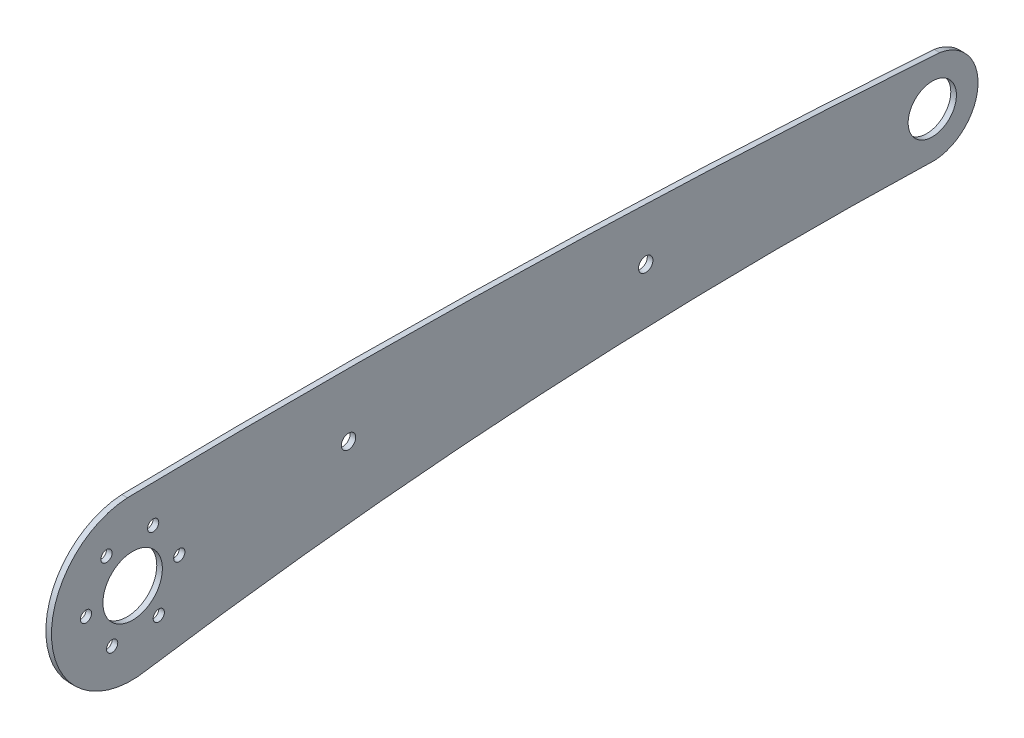
ISO-10303-21;
HEADER;
FILE_DESCRIPTION(('STEP AP214'),'2;1');
FILE_NAME('part.step','',(''),(''),'','','');
FILE_SCHEMA(('AUTOMOTIVE_DESIGN { 1 0 10303 214 1 1 1 1 }'));
ENDSEC;
DATA;
#1=APPLICATION_CONTEXT('core data for automotive mechanical design processes');
#2=APPLICATION_PROTOCOL_DEFINITION('international standard','automotive_design',2000,#1);
#3=PRODUCT_CONTEXT('',#1,'mechanical');
#4=PRODUCT('Part','Part','',(#3));
#5=PRODUCT_RELATED_PRODUCT_CATEGORY('part','',(#4));
#6=PRODUCT_DEFINITION_FORMATION('','',#4);
#7=PRODUCT_DEFINITION_CONTEXT('part definition',#1,'design');
#8=PRODUCT_DEFINITION('design','',#6,#7);
#9=PRODUCT_DEFINITION_SHAPE('','',#8);
#10=(LENGTH_UNIT() NAMED_UNIT(*) SI_UNIT(.MILLI.,.METRE.));
#11=(NAMED_UNIT(*) PLANE_ANGLE_UNIT() SI_UNIT($,.RADIAN.));
#12=(NAMED_UNIT(*) SI_UNIT($,.STERADIAN.) SOLID_ANGLE_UNIT());
#13=UNCERTAINTY_MEASURE_WITH_UNIT(LENGTH_MEASURE(1.E-05),#10,'distance_accuracy_value','');
#14=(GEOMETRIC_REPRESENTATION_CONTEXT(3) GLOBAL_UNCERTAINTY_ASSIGNED_CONTEXT((#13)) GLOBAL_UNIT_ASSIGNED_CONTEXT((#10,
#11,#12)) REPRESENTATION_CONTEXT('',''));
#15=CARTESIAN_POINT('',(0.,0.,0.));
#16=DIRECTION('',(0.,0.,1.));
#17=DIRECTION('',(1.,0.,0.));
#18=AXIS2_PLACEMENT_3D('',#15,#16,#17);
#19=CARTESIAN_POINT('',(1.5,0.0109238249300647,-111.842380336312));
#20=DIRECTION('',(1.,0.,0.));
#21=DIRECTION('',(0.,0.,-1.));
#22=AXIS2_PLACEMENT_3D('',#19,#20,#21);
#23=PLANE('',#22);
#24=CARTESIAN_POINT('',(1.5,5.98288182663587,-35.0010555414686));
#25=DIRECTION('',(1.,0.,0.));
#26=DIRECTION('',(0.,0.,-1.));
#27=AXIS2_PLACEMENT_3D('',#24,#25,#26);
#28=CIRCLE('',#27,1.92499999999995);
#29=CARTESIAN_POINT('',(1.5,5.98288182663587,-36.9260555414685));
#30=VERTEX_POINT('',#29);
#31=EDGE_CURVE('E195',#30,#30,#28,.T.);
#32=ORIENTED_EDGE('',*,*,#31,.F.);
#33=EDGE_LOOP('',(#32));
#34=FACE_BOUND('',#33,.T.);
#35=CARTESIAN_POINT('',(1.5,3.62133303244394,-111.605339345811));
#36=DIRECTION('',(1.,0.,0.));
#37=DIRECTION('',(0.,0.,-1.));
#38=AXIS2_PLACEMENT_3D('',#35,#36,#37);
#39=CIRCLE('',#38,6.45000000001783);
#40=CARTESIAN_POINT('',(1.5,3.62133303244394,-118.055339345829));
#41=VERTEX_POINT('',#40);
#42=EDGE_CURVE('E207',#41,#41,#39,.T.);
#43=ORIENTED_EDGE('',*,*,#42,.F.);
#44=EDGE_LOOP('',(#43));
#45=FACE_BOUND('',#44,.T.);
#46=CARTESIAN_POINT('',(1.5,1.00528743893835,89.6744307665647));
#47=DIRECTION('',(1.,0.,0.));
#48=DIRECTION('',(0.,0.,-1.));
#49=AXIS2_PLACEMENT_3D('',#46,#47,#48);
#50=CIRCLE('',#49,1.50000000000139);
#51=CARTESIAN_POINT('',(1.5,1.00528743893835,88.1744307665633));
#52=VERTEX_POINT('',#51);
#53=EDGE_CURVE('E219',#52,#52,#50,.T.);
#54=ORIENTED_EDGE('',*,*,#53,.F.);
#55=EDGE_LOOP('',(#54));
#56=FACE_BOUND('',#55,.T.);
#57=CARTESIAN_POINT('',(1.5,-11.1015940616008,107.623620729677));
#58=DIRECTION('',(1.,0.,0.));
#59=DIRECTION('',(0.,0.,-1.));
#60=AXIS2_PLACEMENT_3D('',#57,#58,#59);
#61=CIRCLE('',#60,1.50000000000139);
#62=CARTESIAN_POINT('',(1.5,-11.1015940616008,106.123620729676));
#63=VERTEX_POINT('',#62);
#64=EDGE_CURVE('E231',#63,#63,#61,.T.);
#65=ORIENTED_EDGE('',*,*,#64,.F.);
#66=EDGE_LOOP('',(#65));
#67=FACE_BOUND('',#66,.T.);
#68=CARTESIAN_POINT('',(1.5,10.4963011740768,109.133892688195));
#69=DIRECTION('',(1.,0.,0.));
#70=DIRECTION('',(0.,0.,-1.));
#71=AXIS2_PLACEMENT_3D('',#68,#69,#70);
#72=CIRCLE('',#71,1.50000000000139);
#73=CARTESIAN_POINT('',(1.5,10.4963011740768,107.633892688194));
#74=VERTEX_POINT('',#73);
#75=EDGE_CURVE('E111',#74,#74,#72,.T.);
#76=ORIENTED_EDGE('',*,*,#75,.F.);
#77=EDGE_LOOP('',(#76));
#78=FACE_BOUND('',#77,.T.);
#79=CARTESIAN_POINT('',(1.5,-3.59948538258381,-112.079421326813));
#80=DIRECTION('',(1.,0.,0.));
#81=DIRECTION('',(0.,0.,-1.));
#82=AXIS2_PLACEMENT_3D('',#79,#80,#81);
#83=CIRCLE('',#82,4.9999999999999);
#84=CARTESIAN_POINT('',(1.5,-8.57201186270506,-111.555989951663));
#85=VERTEX_POINT('',#84);
#86=CARTESIAN_POINT('',(1.5,-8.58874368837342,-112.406990492162));
#87=VERTEX_POINT('',#86);
#88=EDGE_CURVE('E116',#85,#87,#83,.T.);
#89=ORIENTED_EDGE('',*,*,#88,.T.);
#90=CARTESIAN_POINT('',(1.5,3.62133303244394,-111.605339345811));
#91=DIRECTION('',(1.,0.,0.));
#92=DIRECTION('',(0.,0.,-1.));
#93=AXIS2_PLACEMENT_3D('',#90,#91,#92);
#94=CIRCLE('',#93,12.2363645781209);
#95=CARTESIAN_POINT('',(1.5,15.6965768285633,-113.584507189356));
#96=VERTEX_POINT('',#95);
#97=EDGE_CURVE('E83',#87,#96,#94,.T.);
#98=ORIENTED_EDGE('',*,*,#97,.T.);
#99=CARTESIAN_POINT('',(1.5,-2413.07294376536,56.6324226054489));
#100=DIRECTION('',(1.,0.,0.));
#101=DIRECTION('',(0.,0.,-1.));
#102=AXIS2_PLACEMENT_3D('',#99,#100,#101);
#103=CIRCLE('',#102,2434.72692254281);
#104=CARTESIAN_POINT('',(1.5,21.2020403196569,103.541794938654));
#105=VERTEX_POINT('',#104);
#106=EDGE_CURVE('E87',#96,#105,#103,.T.);
#107=ORIENTED_EDGE('',*,*,#106,.T.);
#108=CARTESIAN_POINT('',(1.5,-0.210717527640014,102.398442674119));
#109=DIRECTION('',(1.,0.,0.));
#110=DIRECTION('',(0.,0.,-1.));
#111=AXIS2_PLACEMENT_3D('',#108,#109,#110);
#112=CIRCLE('',#111,21.4432612498145);
#113=CARTESIAN_POINT('',(1.5,-21.2449303278428,98.2300683023075));
#114=VERTEX_POINT('',#113);
#115=EDGE_CURVE('E91',#105,#114,#112,.T.);
#116=ORIENTED_EDGE('',*,*,#115,.T.);
#117=CARTESIAN_POINT('',(1.5,-1165.50616564437,-76.1691562818783));
#118=DIRECTION('',(-1.,0.,0.));
#119=DIRECTION('',(0.,0.,-1.));
#120=AXIS2_PLACEMENT_3D('',#117,#118,#119);
#121=CIRCLE('',#120,1157.475211045);
#122=EDGE_CURVE('E49',#114,#85,#121,.T.);
#123=ORIENTED_EDGE('',*,*,#122,.T.);
#124=EDGE_LOOP('',(#89,#98,#107,#116,#123));
#125=FACE_BOUND('',#124,.T.);
#126=CARTESIAN_POINT('',(1.5,-0.738624404662103,114.61353202306));
#127=DIRECTION('',(1.,0.,0.));
#128=DIRECTION('',(0.,0.,-1.));
#129=AXIS2_PLACEMENT_3D('',#126,#127,#128);
#130=CIRCLE('',#129,1.50000000000139);
#131=CARTESIAN_POINT('',(1.5,-0.738624404662103,113.113532023059));
#132=VERTEX_POINT('',#131);
#133=EDGE_CURVE('E237',#132,#132,#130,.T.);
#134=ORIENTED_EDGE('',*,*,#133,.F.);
#135=EDGE_LOOP('',(#134));
#136=FACE_BOUND('',#135,.T.);
#137=CARTESIAN_POINT('',(1.5,-10.2296381398006,95.1540701014291));
#138=DIRECTION('',(1.,0.,0.));
#139=DIRECTION('',(0.,0.,-1.));
#140=AXIS2_PLACEMENT_3D('',#137,#138,#139);
#141=CIRCLE('',#140,1.50000000000139);
#142=CARTESIAN_POINT('',(1.5,-10.2296381398006,93.6540701014277));
#143=VERTEX_POINT('',#142);
#144=EDGE_CURVE('E225',#143,#143,#141,.T.);
#145=ORIENTED_EDGE('',*,*,#144,.F.);
#146=EDGE_LOOP('',(#145));
#147=FACE_BOUND('',#146,.T.);
#148=CARTESIAN_POINT('',(1.5,11.3682570958771,96.6643420599476));
#149=DIRECTION('',(1.,0.,0.));
#150=DIRECTION('',(0.,0.,-1.));
#151=AXIS2_PLACEMENT_3D('',#148,#149,#150);
#152=CIRCLE('',#151,1.50000000000139);
#153=CARTESIAN_POINT('',(1.5,11.3682570958771,95.1643420599462));
#154=VERTEX_POINT('',#153);
#155=EDGE_CURVE('E213',#154,#154,#152,.T.);
#156=ORIENTED_EDGE('',*,*,#155,.F.);
#157=EDGE_LOOP('',(#156));
#158=FACE_BOUND('',#157,.T.);
#159=CARTESIAN_POINT('',(1.5,0.133331517138124,102.143981394812));
#160=DIRECTION('',(1.,0.,0.));
#161=DIRECTION('',(0.,0.,-1.));
#162=AXIS2_PLACEMENT_3D('',#159,#160,#161);
#163=CIRCLE('',#162,7.95000000000012);
#164=CARTESIAN_POINT('',(1.5,0.133331517138124,94.1939813948123));
#165=VERTEX_POINT('',#164);
#166=EDGE_CURVE('E201',#165,#165,#163,.T.);
#167=ORIENTED_EDGE('',*,*,#166,.F.);
#168=EDGE_LOOP('',(#167));
#169=FACE_BOUND('',#168,.T.);
#170=CARTESIAN_POINT('',(1.5,4.68666504729787,44.4328136526777));
#171=DIRECTION('',(1.,0.,0.));
#172=DIRECTION('',(0.,0.,-1.));
#173=AXIS2_PLACEMENT_3D('',#170,#171,#172);
#174=CIRCLE('',#173,1.92499999999995);
#175=CARTESIAN_POINT('',(1.5,4.68666504729787,42.5078136526778));
#176=VERTEX_POINT('',#175);
#177=EDGE_CURVE('E186',#176,#176,#174,.T.);
#178=ORIENTED_EDGE('',*,*,#177,.F.);
#179=EDGE_LOOP('',(#178));
#180=FACE_BOUND('',#179,.T.);
#181=ADVANCED_FACE('F32',(#34,#45,#56,#67,#78,#125,#136,#147,#158,#169,#180),#23,.T.);
#182=CARTESIAN_POINT('',(0.,0.0109238249300647,-111.842380336312));
#183=DIRECTION('',(1.,0.,0.));
#184=DIRECTION('',(0.,0.,-1.));
#185=AXIS2_PLACEMENT_3D('',#182,#183,#184);
#186=PLANE('',#185);
#187=CARTESIAN_POINT('',(0.,-3.59948538258381,-112.079421326813));
#188=DIRECTION('',(1.,0.,0.));
#189=DIRECTION('',(0.,0.,-1.));
#190=AXIS2_PLACEMENT_3D('',#187,#188,#189);
#191=CIRCLE('',#190,4.9999999999999);
#192=CARTESIAN_POINT('',(0.,-8.57201186270506,-111.555989951663));
#193=VERTEX_POINT('',#192);
#194=CARTESIAN_POINT('',(0.,-8.58874368837342,-112.406990492162));
#195=VERTEX_POINT('',#194);
#196=EDGE_CURVE('E107',#193,#195,#191,.T.);
#197=ORIENTED_EDGE('',*,*,#196,.F.);
#198=CARTESIAN_POINT('',(0.,-1165.50616564437,-76.1691562818783));
#199=DIRECTION('',(-1.,0.,0.));
#200=DIRECTION('',(0.,0.,-1.));
#201=AXIS2_PLACEMENT_3D('',#198,#199,#200);
#202=CIRCLE('',#201,1157.475211045);
#203=CARTESIAN_POINT('',(0.,-21.2449303278428,98.2300683023075));
#204=VERTEX_POINT('',#203);
#205=EDGE_CURVE('E75',#204,#193,#202,.T.);
#206=ORIENTED_EDGE('',*,*,#205,.F.);
#207=CARTESIAN_POINT('',(0.,-0.210717527640014,102.398442674119));
#208=DIRECTION('',(1.,0.,0.));
#209=DIRECTION('',(0.,0.,-1.));
#210=AXIS2_PLACEMENT_3D('',#207,#208,#209);
#211=CIRCLE('',#210,21.4432612498145);
#212=CARTESIAN_POINT('',(0.,21.2020403196569,103.541794938654));
#213=VERTEX_POINT('',#212);
#214=EDGE_CURVE('E69',#213,#204,#211,.T.);
#215=ORIENTED_EDGE('',*,*,#214,.F.);
#216=CARTESIAN_POINT('',(0.,-2413.07294376536,56.6324226054489));
#217=DIRECTION('',(1.,0.,0.));
#218=DIRECTION('',(0.,0.,-1.));
#219=AXIS2_PLACEMENT_3D('',#216,#217,#218);
#220=CIRCLE('',#219,2434.72692254281);
#221=CARTESIAN_POINT('',(0.,15.6965768285633,-113.584507189356));
#222=VERTEX_POINT('',#221);
#223=EDGE_CURVE('E98',#222,#213,#220,.T.);
#224=ORIENTED_EDGE('',*,*,#223,.F.);
#225=CARTESIAN_POINT('',(0.,3.62133303244394,-111.605339345811));
#226=DIRECTION('',(1.,0.,0.));
#227=DIRECTION('',(0.,0.,-1.));
#228=AXIS2_PLACEMENT_3D('',#225,#226,#227);
#229=CIRCLE('',#228,12.2363645781209);
#230=EDGE_CURVE('E110',#195,#222,#229,.T.);
#231=ORIENTED_EDGE('',*,*,#230,.F.);
#232=EDGE_LOOP('',(#197,#206,#215,#224,#231));
#233=FACE_BOUND('',#232,.T.);
#234=CARTESIAN_POINT('',(0.,10.4963011740768,109.133892688195));
#235=DIRECTION('',(1.,0.,0.));
#236=DIRECTION('',(0.,0.,-1.));
#237=AXIS2_PLACEMENT_3D('',#234,#235,#236);
#238=CIRCLE('',#237,1.50000000000139);
#239=CARTESIAN_POINT('',(0.,10.4963011740768,107.633892688194));
#240=VERTEX_POINT('',#239);
#241=EDGE_CURVE('E240',#240,#240,#238,.T.);
#242=ORIENTED_EDGE('',*,*,#241,.T.);
#243=EDGE_LOOP('',(#242));
#244=FACE_BOUND('',#243,.T.);
#245=CARTESIAN_POINT('',(0.,-0.738624404662103,114.61353202306));
#246=DIRECTION('',(1.,0.,0.));
#247=DIRECTION('',(0.,0.,-1.));
#248=AXIS2_PLACEMENT_3D('',#245,#246,#247);
#249=CIRCLE('',#248,1.50000000000139);
#250=CARTESIAN_POINT('',(0.,-0.738624404662103,113.113532023059));
#251=VERTEX_POINT('',#250);
#252=EDGE_CURVE('E234',#251,#251,#249,.T.);
#253=ORIENTED_EDGE('',*,*,#252,.T.);
#254=EDGE_LOOP('',(#253));
#255=FACE_BOUND('',#254,.T.);
#256=CARTESIAN_POINT('',(0.,-11.1015940616008,107.623620729677));
#257=DIRECTION('',(1.,0.,0.));
#258=DIRECTION('',(0.,0.,-1.));
#259=AXIS2_PLACEMENT_3D('',#256,#257,#258);
#260=CIRCLE('',#259,1.50000000000139);
#261=CARTESIAN_POINT('',(0.,-11.1015940616008,106.123620729676));
#262=VERTEX_POINT('',#261);
#263=EDGE_CURVE('E228',#262,#262,#260,.T.);
#264=ORIENTED_EDGE('',*,*,#263,.T.);
#265=EDGE_LOOP('',(#264));
#266=FACE_BOUND('',#265,.T.);
#267=CARTESIAN_POINT('',(0.,-10.2296381398006,95.1540701014291));
#268=DIRECTION('',(1.,0.,0.));
#269=DIRECTION('',(0.,0.,-1.));
#270=AXIS2_PLACEMENT_3D('',#267,#268,#269);
#271=CIRCLE('',#270,1.50000000000139);
#272=CARTESIAN_POINT('',(0.,-10.2296381398006,93.6540701014277));
#273=VERTEX_POINT('',#272);
#274=EDGE_CURVE('E222',#273,#273,#271,.T.);
#275=ORIENTED_EDGE('',*,*,#274,.T.);
#276=EDGE_LOOP('',(#275));
#277=FACE_BOUND('',#276,.T.);
#278=CARTESIAN_POINT('',(0.,1.00528743893835,89.6744307665647));
#279=DIRECTION('',(1.,0.,0.));
#280=DIRECTION('',(0.,0.,-1.));
#281=AXIS2_PLACEMENT_3D('',#278,#279,#280);
#282=CIRCLE('',#281,1.50000000000139);
#283=CARTESIAN_POINT('',(0.,1.00528743893835,88.1744307665633));
#284=VERTEX_POINT('',#283);
#285=EDGE_CURVE('E216',#284,#284,#282,.T.);
#286=ORIENTED_EDGE('',*,*,#285,.T.);
#287=EDGE_LOOP('',(#286));
#288=FACE_BOUND('',#287,.T.);
#289=CARTESIAN_POINT('',(0.,11.3682570958771,96.6643420599476));
#290=DIRECTION('',(1.,0.,0.));
#291=DIRECTION('',(0.,0.,-1.));
#292=AXIS2_PLACEMENT_3D('',#289,#290,#291);
#293=CIRCLE('',#292,1.50000000000139);
#294=CARTESIAN_POINT('',(0.,11.3682570958771,95.1643420599462));
#295=VERTEX_POINT('',#294);
#296=EDGE_CURVE('E210',#295,#295,#293,.T.);
#297=ORIENTED_EDGE('',*,*,#296,.T.);
#298=EDGE_LOOP('',(#297));
#299=FACE_BOUND('',#298,.T.);
#300=CARTESIAN_POINT('',(0.,3.62133303244394,-111.605339345811));
#301=DIRECTION('',(1.,0.,0.));
#302=DIRECTION('',(0.,0.,-1.));
#303=AXIS2_PLACEMENT_3D('',#300,#301,#302);
#304=CIRCLE('',#303,6.45000000001783);
#305=CARTESIAN_POINT('',(0.,3.62133303244394,-118.055339345829));
#306=VERTEX_POINT('',#305);
#307=EDGE_CURVE('E204',#306,#306,#304,.T.);
#308=ORIENTED_EDGE('',*,*,#307,.T.);
#309=EDGE_LOOP('',(#308));
#310=FACE_BOUND('',#309,.T.);
#311=CARTESIAN_POINT('',(0.,0.133331517138124,102.143981394812));
#312=DIRECTION('',(1.,0.,0.));
#313=DIRECTION('',(0.,0.,-1.));
#314=AXIS2_PLACEMENT_3D('',#311,#312,#313);
#315=CIRCLE('',#314,7.95000000000012);
#316=CARTESIAN_POINT('',(0.,0.133331517138124,94.1939813948123));
#317=VERTEX_POINT('',#316);
#318=EDGE_CURVE('E198',#317,#317,#315,.T.);
#319=ORIENTED_EDGE('',*,*,#318,.T.);
#320=EDGE_LOOP('',(#319));
#321=FACE_BOUND('',#320,.T.);
#322=CARTESIAN_POINT('',(0.,5.98288182663587,-35.0010555414686));
#323=DIRECTION('',(1.,0.,0.));
#324=DIRECTION('',(0.,0.,-1.));
#325=AXIS2_PLACEMENT_3D('',#322,#323,#324);
#326=CIRCLE('',#325,1.92499999999995);
#327=CARTESIAN_POINT('',(0.,5.98288182663587,-36.9260555414685));
#328=VERTEX_POINT('',#327);
#329=EDGE_CURVE('E192',#328,#328,#326,.T.);
#330=ORIENTED_EDGE('',*,*,#329,.T.);
#331=EDGE_LOOP('',(#330));
#332=FACE_BOUND('',#331,.T.);
#333=CARTESIAN_POINT('',(0.,4.68666504729787,44.4328136526777));
#334=DIRECTION('',(1.,0.,0.));
#335=DIRECTION('',(0.,0.,-1.));
#336=AXIS2_PLACEMENT_3D('',#333,#334,#335);
#337=CIRCLE('',#336,1.92499999999995);
#338=CARTESIAN_POINT('',(0.,4.68666504729787,42.5078136526778));
#339=VERTEX_POINT('',#338);
#340=EDGE_CURVE('E189',#339,#339,#337,.T.);
#341=ORIENTED_EDGE('',*,*,#340,.T.);
#342=EDGE_LOOP('',(#341));
#343=FACE_BOUND('',#342,.T.);
#344=ADVANCED_FACE('F120',(#233,#244,#255,#266,#277,#288,#299,#310,#321,#332,#343),#186,.F.);
#345=CARTESIAN_POINT('',(1.5,-3.59948538258381,-112.079421326813));
#346=DIRECTION('',(-1.,0.,0.));
#347=DIRECTION('',(0.,0.,1.));
#348=AXIS2_PLACEMENT_3D('',#345,#346,#347);
#349=CYLINDRICAL_SURFACE('',#348,4.9999999999999);
#350=ORIENTED_EDGE('',*,*,#196,.T.);
#351=DIRECTION('',(-1.,0.,0.));
#352=VECTOR('',#351,1.);
#353=CARTESIAN_POINT('',(1.5,-8.58874368837342,-112.406990492162));
#354=LINE('',#353,#352);
#355=EDGE_CURVE('E11',#87,#195,#354,.T.);
#356=ORIENTED_EDGE('',*,*,#355,.F.);
#357=ORIENTED_EDGE('',*,*,#88,.F.);
#358=DIRECTION('',(-1.,0.,0.));
#359=VECTOR('',#358,1.);
#360=CARTESIAN_POINT('',(1.5,-8.57201186270506,-111.555989951663));
#361=LINE('',#360,#359);
#362=EDGE_CURVE('E103',#85,#193,#361,.T.);
#363=ORIENTED_EDGE('',*,*,#362,.T.);
#364=EDGE_LOOP('',(#350,#356,#357,#363));
#365=FACE_BOUND('',#364,.T.);
#366=ADVANCED_FACE('F34',(#365),#349,.T.);
#367=CARTESIAN_POINT('',(1.5,3.62133303244394,-111.605339345811));
#368=DIRECTION('',(-1.,0.,0.));
#369=DIRECTION('',(0.,0.,1.));
#370=AXIS2_PLACEMENT_3D('',#367,#368,#369);
#371=CYLINDRICAL_SURFACE('',#370,12.2363645781209);
#372=ORIENTED_EDGE('',*,*,#230,.T.);
#373=DIRECTION('',(-1.,0.,0.));
#374=VECTOR('',#373,1.);
#375=CARTESIAN_POINT('',(1.5,15.6965768285633,-113.584507189356));
#376=LINE('',#375,#374);
#377=EDGE_CURVE('E41',#96,#222,#376,.T.);
#378=ORIENTED_EDGE('',*,*,#377,.F.);
#379=ORIENTED_EDGE('',*,*,#97,.F.);
#380=ORIENTED_EDGE('',*,*,#355,.T.);
#381=EDGE_LOOP('',(#372,#378,#379,#380));
#382=FACE_BOUND('',#381,.T.);
#383=ADVANCED_FACE('F343',(#382),#371,.T.);
#384=CARTESIAN_POINT('',(1.5,-2413.07294376536,56.6324226054489));
#385=DIRECTION('',(-1.,0.,0.));
#386=DIRECTION('',(0.,0.,1.));
#387=AXIS2_PLACEMENT_3D('',#384,#385,#386);
#388=CYLINDRICAL_SURFACE('',#387,2434.72692254281);
#389=ORIENTED_EDGE('',*,*,#223,.T.);
#390=DIRECTION('',(-1.,0.,0.));
#391=VECTOR('',#390,1.);
#392=CARTESIAN_POINT('',(1.5,21.2020403196569,103.541794938654));
#393=LINE('',#392,#391);
#394=EDGE_CURVE('E95',#105,#213,#393,.T.);
#395=ORIENTED_EDGE('',*,*,#394,.F.);
#396=ORIENTED_EDGE('',*,*,#106,.F.);
#397=ORIENTED_EDGE('',*,*,#377,.T.);
#398=EDGE_LOOP('',(#389,#395,#396,#397));
#399=FACE_BOUND('',#398,.T.);
#400=ADVANCED_FACE('F96',(#399),#388,.T.);
#401=CARTESIAN_POINT('',(1.5,-0.210717527640014,102.398442674119));
#402=DIRECTION('',(-1.,0.,0.));
#403=DIRECTION('',(0.,0.,1.));
#404=AXIS2_PLACEMENT_3D('',#401,#402,#403);
#405=CYLINDRICAL_SURFACE('',#404,21.4432612498145);
#406=ORIENTED_EDGE('',*,*,#214,.T.);
#407=DIRECTION('',(-1.,0.,0.));
#408=VECTOR('',#407,1.);
#409=CARTESIAN_POINT('',(1.5,-21.2449303278428,98.2300683023075));
#410=LINE('',#409,#408);
#411=EDGE_CURVE('E99',#114,#204,#410,.T.);
#412=ORIENTED_EDGE('',*,*,#411,.F.);
#413=ORIENTED_EDGE('',*,*,#115,.F.);
#414=ORIENTED_EDGE('',*,*,#394,.T.);
#415=EDGE_LOOP('',(#406,#412,#413,#414));
#416=FACE_BOUND('',#415,.T.);
#417=ADVANCED_FACE('F101',(#416),#405,.T.);
#418=CARTESIAN_POINT('',(1.5,-1165.50616564437,-76.1691562818783));
#419=DIRECTION('',(-1.,0.,0.));
#420=DIRECTION('',(0.,0.,1.));
#421=AXIS2_PLACEMENT_3D('',#418,#419,#420);
#422=CYLINDRICAL_SURFACE('',#421,1157.475211045);
#423=ORIENTED_EDGE('',*,*,#205,.T.);
#424=ORIENTED_EDGE('',*,*,#362,.F.);
#425=ORIENTED_EDGE('',*,*,#122,.F.);
#426=ORIENTED_EDGE('',*,*,#411,.T.);
#427=EDGE_LOOP('',(#423,#424,#425,#426));
#428=FACE_BOUND('',#427,.T.);
#429=ADVANCED_FACE('F125',(#428),#422,.F.);
#430=CARTESIAN_POINT('',(1.5,10.4963011740768,109.133892688195));
#431=DIRECTION('',(-1.,0.,0.));
#432=DIRECTION('',(0.,0.,1.));
#433=AXIS2_PLACEMENT_3D('',#430,#431,#432);
#434=CYLINDRICAL_SURFACE('',#433,1.50000000000139);
#435=ORIENTED_EDGE('',*,*,#75,.T.);
#436=EDGE_LOOP('',(#435));
#437=FACE_BOUND('',#436,.T.);
#438=ORIENTED_EDGE('',*,*,#241,.F.);
#439=EDGE_LOOP('',(#438));
#440=FACE_BOUND('',#439,.T.);
#441=ADVANCED_FACE('F127',(#437,#440),#434,.F.);
#442=CARTESIAN_POINT('',(1.5,-0.738624404662103,114.61353202306));
#443=DIRECTION('',(-1.,0.,0.));
#444=DIRECTION('',(0.,0.,1.));
#445=AXIS2_PLACEMENT_3D('',#442,#443,#444);
#446=CYLINDRICAL_SURFACE('',#445,1.50000000000139);
#447=ORIENTED_EDGE('',*,*,#133,.T.);
#448=EDGE_LOOP('',(#447));
#449=FACE_BOUND('',#448,.T.);
#450=ORIENTED_EDGE('',*,*,#252,.F.);
#451=EDGE_LOOP('',(#450));
#452=FACE_BOUND('',#451,.T.);
#453=ADVANCED_FACE('F133',(#449,#452),#446,.F.);
#454=CARTESIAN_POINT('',(1.5,-11.1015940616008,107.623620729677));
#455=DIRECTION('',(-1.,0.,0.));
#456=DIRECTION('',(0.,0.,1.));
#457=AXIS2_PLACEMENT_3D('',#454,#455,#456);
#458=CYLINDRICAL_SURFACE('',#457,1.50000000000139);
#459=ORIENTED_EDGE('',*,*,#64,.T.);
#460=EDGE_LOOP('',(#459));
#461=FACE_BOUND('',#460,.T.);
#462=ORIENTED_EDGE('',*,*,#263,.F.);
#463=EDGE_LOOP('',(#462));
#464=FACE_BOUND('',#463,.T.);
#465=ADVANCED_FACE('F149',(#461,#464),#458,.F.);
#466=CARTESIAN_POINT('',(1.5,-10.2296381398006,95.1540701014291));
#467=DIRECTION('',(-1.,0.,0.));
#468=DIRECTION('',(0.,0.,1.));
#469=AXIS2_PLACEMENT_3D('',#466,#467,#468);
#470=CYLINDRICAL_SURFACE('',#469,1.50000000000139);
#471=ORIENTED_EDGE('',*,*,#144,.T.);
#472=EDGE_LOOP('',(#471));
#473=FACE_BOUND('',#472,.T.);
#474=ORIENTED_EDGE('',*,*,#274,.F.);
#475=EDGE_LOOP('',(#474));
#476=FACE_BOUND('',#475,.T.);
#477=ADVANCED_FACE('F153',(#473,#476),#470,.F.);
#478=CARTESIAN_POINT('',(1.5,1.00528743893835,89.6744307665647));
#479=DIRECTION('',(-1.,0.,0.));
#480=DIRECTION('',(0.,0.,1.));
#481=AXIS2_PLACEMENT_3D('',#478,#479,#480);
#482=CYLINDRICAL_SURFACE('',#481,1.50000000000139);
#483=ORIENTED_EDGE('',*,*,#53,.T.);
#484=EDGE_LOOP('',(#483));
#485=FACE_BOUND('',#484,.T.);
#486=ORIENTED_EDGE('',*,*,#285,.F.);
#487=EDGE_LOOP('',(#486));
#488=FACE_BOUND('',#487,.T.);
#489=ADVANCED_FACE('F157',(#485,#488),#482,.F.);
#490=CARTESIAN_POINT('',(1.5,11.3682570958771,96.6643420599476));
#491=DIRECTION('',(-1.,0.,0.));
#492=DIRECTION('',(0.,0.,1.));
#493=AXIS2_PLACEMENT_3D('',#490,#491,#492);
#494=CYLINDRICAL_SURFACE('',#493,1.50000000000139);
#495=ORIENTED_EDGE('',*,*,#155,.T.);
#496=EDGE_LOOP('',(#495));
#497=FACE_BOUND('',#496,.T.);
#498=ORIENTED_EDGE('',*,*,#296,.F.);
#499=EDGE_LOOP('',(#498));
#500=FACE_BOUND('',#499,.T.);
#501=ADVANCED_FACE('F161',(#497,#500),#494,.F.);
#502=CARTESIAN_POINT('',(1.5,3.62133303244394,-111.605339345811));
#503=DIRECTION('',(-1.,0.,0.));
#504=DIRECTION('',(0.,0.,1.));
#505=AXIS2_PLACEMENT_3D('',#502,#503,#504);
#506=CYLINDRICAL_SURFACE('',#505,6.45000000001783);
#507=ORIENTED_EDGE('',*,*,#42,.T.);
#508=EDGE_LOOP('',(#507));
#509=FACE_BOUND('',#508,.T.);
#510=ORIENTED_EDGE('',*,*,#307,.F.);
#511=EDGE_LOOP('',(#510));
#512=FACE_BOUND('',#511,.T.);
#513=ADVANCED_FACE('F165',(#509,#512),#506,.F.);
#514=CARTESIAN_POINT('',(1.5,0.133331517138124,102.143981394812));
#515=DIRECTION('',(-1.,0.,0.));
#516=DIRECTION('',(0.,0.,1.));
#517=AXIS2_PLACEMENT_3D('',#514,#515,#516);
#518=CYLINDRICAL_SURFACE('',#517,7.95000000000012);
#519=ORIENTED_EDGE('',*,*,#166,.T.);
#520=EDGE_LOOP('',(#519));
#521=FACE_BOUND('',#520,.T.);
#522=ORIENTED_EDGE('',*,*,#318,.F.);
#523=EDGE_LOOP('',(#522));
#524=FACE_BOUND('',#523,.T.);
#525=ADVANCED_FACE('F169',(#521,#524),#518,.F.);
#526=CARTESIAN_POINT('',(1.5,5.98288182663587,-35.0010555414686));
#527=DIRECTION('',(-1.,0.,0.));
#528=DIRECTION('',(0.,0.,1.));
#529=AXIS2_PLACEMENT_3D('',#526,#527,#528);
#530=CYLINDRICAL_SURFACE('',#529,1.92499999999995);
#531=ORIENTED_EDGE('',*,*,#31,.T.);
#532=EDGE_LOOP('',(#531));
#533=FACE_BOUND('',#532,.T.);
#534=ORIENTED_EDGE('',*,*,#329,.F.);
#535=EDGE_LOOP('',(#534));
#536=FACE_BOUND('',#535,.T.);
#537=ADVANCED_FACE('F173',(#533,#536),#530,.F.);
#538=CARTESIAN_POINT('',(1.5,4.68666504729787,44.4328136526777));
#539=DIRECTION('',(-1.,0.,0.));
#540=DIRECTION('',(0.,0.,1.));
#541=AXIS2_PLACEMENT_3D('',#538,#539,#540);
#542=CYLINDRICAL_SURFACE('',#541,1.92499999999995);
#543=ORIENTED_EDGE('',*,*,#177,.T.);
#544=EDGE_LOOP('',(#543));
#545=FACE_BOUND('',#544,.T.);
#546=ORIENTED_EDGE('',*,*,#340,.F.);
#547=EDGE_LOOP('',(#546));
#548=FACE_BOUND('',#547,.T.);
#549=ADVANCED_FACE('F177',(#545,#548),#542,.F.);
#550=CLOSED_SHELL('',(#181,#344,#366,#383,#400,#417,#429,#441,#453,#465,#477,#489,#501,#513,
#525,#537,#549));
#551=MANIFOLD_SOLID_BREP('B2',#550);
#552=ADVANCED_BREP_SHAPE_REPRESENTATION('',(#18,#551),#14);
#553=SHAPE_DEFINITION_REPRESENTATION(#9,#552);
ENDSEC;
END-ISO-10303-21;
